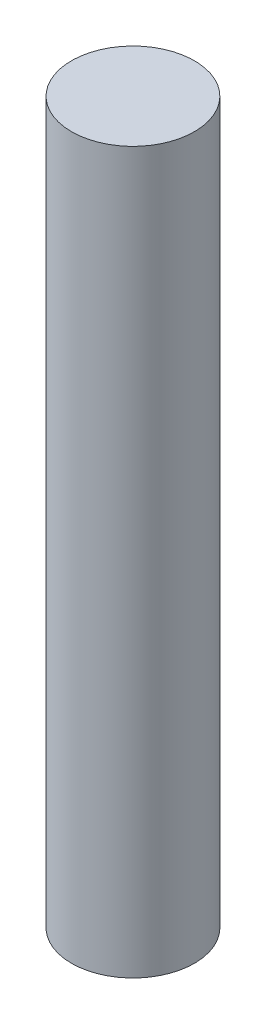
ISO-10303-21;
HEADER;
FILE_DESCRIPTION(('STEP AP214'),'2;1');
FILE_NAME('part.step','',(''),(''),'','','');
FILE_SCHEMA(('AUTOMOTIVE_DESIGN { 1 0 10303 214 1 1 1 1 }'));
ENDSEC;
DATA;
#1=APPLICATION_CONTEXT('core data for automotive mechanical design processes');
#2=APPLICATION_PROTOCOL_DEFINITION('international standard','automotive_design',2000,#1);
#3=PRODUCT_CONTEXT('',#1,'mechanical');
#4=PRODUCT('Part','Part','',(#3));
#5=PRODUCT_RELATED_PRODUCT_CATEGORY('part','',(#4));
#6=PRODUCT_DEFINITION_FORMATION('','',#4);
#7=PRODUCT_DEFINITION_CONTEXT('part definition',#1,'design');
#8=PRODUCT_DEFINITION('design','',#6,#7);
#9=PRODUCT_DEFINITION_SHAPE('','',#8);
#10=(LENGTH_UNIT() NAMED_UNIT(*) SI_UNIT(.MILLI.,.METRE.));
#11=(NAMED_UNIT(*) PLANE_ANGLE_UNIT() SI_UNIT($,.RADIAN.));
#12=(NAMED_UNIT(*) SI_UNIT($,.STERADIAN.) SOLID_ANGLE_UNIT());
#13=UNCERTAINTY_MEASURE_WITH_UNIT(LENGTH_MEASURE(1.E-05),#10,'distance_accuracy_value','');
#14=(GEOMETRIC_REPRESENTATION_CONTEXT(3) GLOBAL_UNCERTAINTY_ASSIGNED_CONTEXT((#13)) GLOBAL_UNIT_ASSIGNED_CONTEXT((#10,
#11,#12)) REPRESENTATION_CONTEXT('',''));
#15=CARTESIAN_POINT('',(0.,0.,0.));
#16=DIRECTION('',(0.,0.,1.));
#17=DIRECTION('',(1.,0.,0.));
#18=AXIS2_PLACEMENT_3D('',#15,#16,#17);
#19=CARTESIAN_POINT('',(0.,93.,0.));
#20=DIRECTION('',(0.,-1.,0.));
#21=DIRECTION('',(0.,0.,-1.));
#22=AXIS2_PLACEMENT_3D('',#19,#20,#21);
#23=CYLINDRICAL_SURFACE('',#22,7.9375);
#24=CARTESIAN_POINT('',(0.,93.,0.));
#25=DIRECTION('',(0.,1.,0.));
#26=DIRECTION('',(0.,0.,1.));
#27=AXIS2_PLACEMENT_3D('',#24,#25,#26);
#28=CIRCLE('',#27,7.9375);
#29=CARTESIAN_POINT('',(0.,93.,7.9375));
#30=VERTEX_POINT('',#29);
#31=EDGE_CURVE('E10',#30,#30,#28,.T.);
#32=ORIENTED_EDGE('',*,*,#31,.F.);
#33=EDGE_LOOP('',(#32));
#34=FACE_BOUND('',#33,.T.);
#35=CARTESIAN_POINT('',(0.,0.,0.));
#36=DIRECTION('',(0.,1.,0.));
#37=DIRECTION('',(0.,0.,1.));
#38=AXIS2_PLACEMENT_3D('',#35,#36,#37);
#39=CIRCLE('',#38,7.9375);
#40=CARTESIAN_POINT('',(0.,0.,7.9375));
#41=VERTEX_POINT('',#40);
#42=EDGE_CURVE('E34',#41,#41,#39,.T.);
#43=ORIENTED_EDGE('',*,*,#42,.T.);
#44=EDGE_LOOP('',(#43));
#45=FACE_BOUND('',#44,.T.);
#46=ADVANCED_FACE('F31',(#34,#45),#23,.T.);
#47=CARTESIAN_POINT('',(0.,93.,0.));
#48=DIRECTION('',(0.,1.,0.));
#49=DIRECTION('',(0.,0.,1.));
#50=AXIS2_PLACEMENT_3D('',#47,#48,#49);
#51=PLANE('',#50);
#52=ORIENTED_EDGE('',*,*,#31,.T.);
#53=EDGE_LOOP('',(#52));
#54=FACE_BOUND('',#53,.T.);
#55=ADVANCED_FACE('F46',(#54),#51,.T.);
#56=CARTESIAN_POINT('',(0.,0.,0.));
#57=DIRECTION('',(0.,1.,0.));
#58=DIRECTION('',(0.,0.,1.));
#59=AXIS2_PLACEMENT_3D('',#56,#57,#58);
#60=PLANE('',#59);
#61=ORIENTED_EDGE('',*,*,#42,.F.);
#62=EDGE_LOOP('',(#61));
#63=FACE_BOUND('',#62,.T.);
#64=ADVANCED_FACE('F44',(#63),#60,.F.);
#65=CLOSED_SHELL('',(#46,#55,#64));
#66=MANIFOLD_SOLID_BREP('B2',#65);
#67=ADVANCED_BREP_SHAPE_REPRESENTATION('',(#18,#66),#14);
#68=SHAPE_DEFINITION_REPRESENTATION(#9,#67);
ENDSEC;
END-ISO-10303-21;
